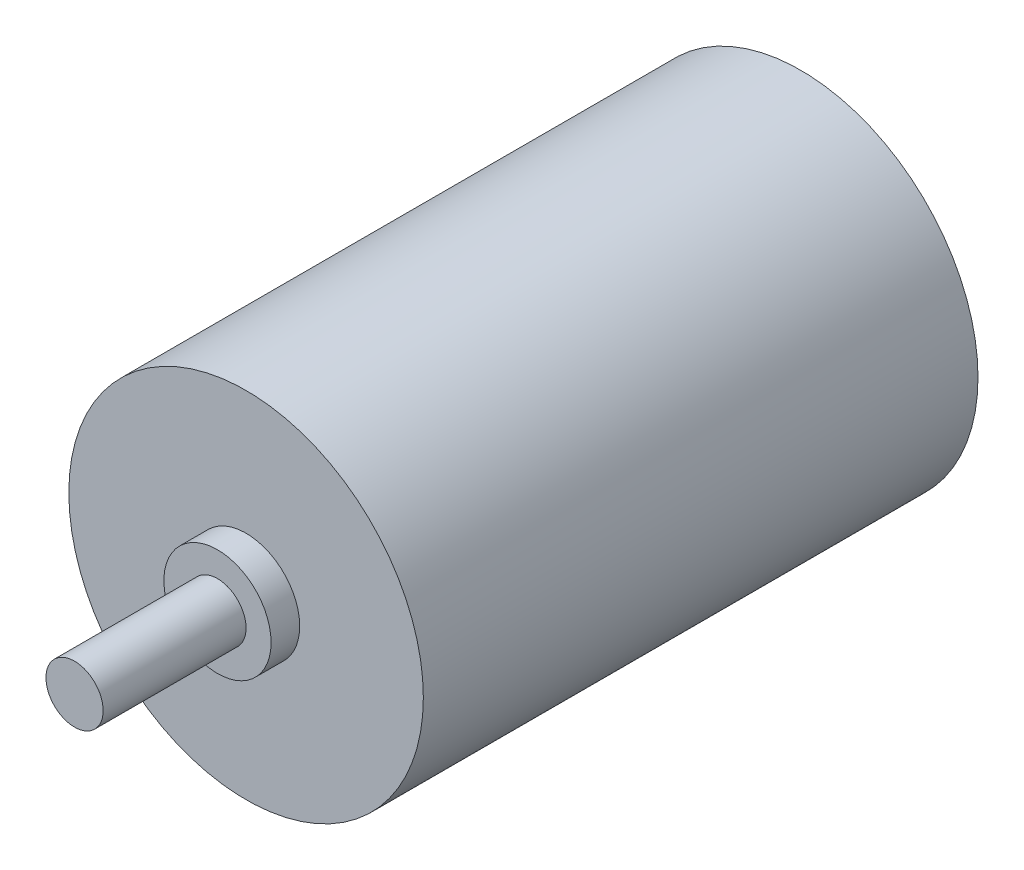
ISO-10303-21;
HEADER;
FILE_DESCRIPTION(('STEP AP214'),'2;1');
FILE_NAME('part.step','',(''),(''),'','','');
FILE_SCHEMA(('AUTOMOTIVE_DESIGN { 1 0 10303 214 1 1 1 1 }'));
ENDSEC;
DATA;
#1=APPLICATION_CONTEXT('core data for automotive mechanical design processes');
#2=APPLICATION_PROTOCOL_DEFINITION('international standard','automotive_design',2000,#1);
#3=PRODUCT_CONTEXT('',#1,'mechanical');
#4=PRODUCT('Part','Part','',(#3));
#5=PRODUCT_RELATED_PRODUCT_CATEGORY('part','',(#4));
#6=PRODUCT_DEFINITION_FORMATION('','',#4);
#7=PRODUCT_DEFINITION_CONTEXT('part definition',#1,'design');
#8=PRODUCT_DEFINITION('design','',#6,#7);
#9=PRODUCT_DEFINITION_SHAPE('','',#8);
#10=(LENGTH_UNIT() NAMED_UNIT(*) SI_UNIT(.MILLI.,.METRE.));
#11=(NAMED_UNIT(*) PLANE_ANGLE_UNIT() SI_UNIT($,.RADIAN.));
#12=(NAMED_UNIT(*) SI_UNIT($,.STERADIAN.) SOLID_ANGLE_UNIT());
#13=UNCERTAINTY_MEASURE_WITH_UNIT(LENGTH_MEASURE(1.E-05),#10,'distance_accuracy_value','');
#14=(GEOMETRIC_REPRESENTATION_CONTEXT(3) GLOBAL_UNCERTAINTY_ASSIGNED_CONTEXT((#13)) GLOBAL_UNIT_ASSIGNED_CONTEXT((#10,
#11,#12)) REPRESENTATION_CONTEXT('',''));
#15=CARTESIAN_POINT('',(0.,0.,0.));
#16=DIRECTION('',(0.,0.,1.));
#17=DIRECTION('',(1.,0.,0.));
#18=AXIS2_PLACEMENT_3D('',#15,#16,#17);
#19=CARTESIAN_POINT('',(0.,0.,0.));
#20=DIRECTION('',(0.,0.,1.));
#21=DIRECTION('',(1.,0.,0.));
#22=AXIS2_PLACEMENT_3D('',#19,#20,#21);
#23=PLANE('',#22);
#24=CARTESIAN_POINT('',(0.,0.,0.));
#25=DIRECTION('',(0.,0.,1.));
#26=DIRECTION('',(1.,0.,0.));
#27=AXIS2_PLACEMENT_3D('',#24,#25,#26);
#28=CIRCLE('',#27,12.4);
#29=CARTESIAN_POINT('',(12.4,0.,0.));
#30=VERTEX_POINT('',#29);
#31=EDGE_CURVE('E40',#30,#30,#28,.T.);
#32=ORIENTED_EDGE('',*,*,#31,.F.);
#33=EDGE_LOOP('',(#32));
#34=FACE_BOUND('',#33,.T.);
#35=DIRECTION('',(0.,-1.,0.));
#36=VECTOR('',#35,1.);
#37=CARTESIAN_POINT('',(3.5,-8.,0.));
#38=LINE('',#37,#36);
#39=CARTESIAN_POINT('',(3.5,-8.,0.));
#40=VERTEX_POINT('',#39);
#41=CARTESIAN_POINT('',(3.5,-10.,0.));
#42=VERTEX_POINT('',#41);
#43=EDGE_CURVE('E97',#40,#42,#38,.T.);
#44=ORIENTED_EDGE('',*,*,#43,.F.);
#45=DIRECTION('',(1.,0.,0.));
#46=VECTOR('',#45,1.);
#47=CARTESIAN_POINT('',(-3.5,-8.,0.));
#48=LINE('',#47,#46);
#49=CARTESIAN_POINT('',(-3.5,-8.,0.));
#50=VERTEX_POINT('',#49);
#51=EDGE_CURVE('E94',#50,#40,#48,.T.);
#52=ORIENTED_EDGE('',*,*,#51,.F.);
#53=DIRECTION('',(0.,1.,0.));
#54=VECTOR('',#53,1.);
#55=CARTESIAN_POINT('',(-3.5,-8.,0.));
#56=LINE('',#55,#54);
#57=CARTESIAN_POINT('',(-3.5,-10.,0.));
#58=VERTEX_POINT('',#57);
#59=EDGE_CURVE('E56',#58,#50,#56,.T.);
#60=ORIENTED_EDGE('',*,*,#59,.F.);
#61=DIRECTION('',(-1.,0.,0.));
#62=VECTOR('',#61,1.);
#63=CARTESIAN_POINT('',(-3.5,-10.,0.));
#64=LINE('',#63,#62);
#65=EDGE_CURVE('E51',#42,#58,#64,.T.);
#66=ORIENTED_EDGE('',*,*,#65,.F.);
#67=EDGE_LOOP('',(#44,#52,#60,#66));
#68=FACE_BOUND('',#67,.T.);
#69=ADVANCED_FACE('F36',(#34,#68),#23,.F.);
#70=CARTESIAN_POINT('',(0.,0.,38.8));
#71=DIRECTION('',(0.,0.,-1.));
#72=DIRECTION('',(-1.,0.,0.));
#73=AXIS2_PLACEMENT_3D('',#70,#71,#72);
#74=CYLINDRICAL_SURFACE('',#73,12.4);
#75=CARTESIAN_POINT('',(0.,0.,38.8));
#76=DIRECTION('',(0.,0.,1.));
#77=DIRECTION('',(1.,0.,0.));
#78=AXIS2_PLACEMENT_3D('',#75,#76,#77);
#79=CIRCLE('',#78,12.4);
#80=CARTESIAN_POINT('',(12.4,0.,38.8));
#81=VERTEX_POINT('',#80);
#82=EDGE_CURVE('E11',#81,#81,#79,.T.);
#83=ORIENTED_EDGE('',*,*,#82,.F.);
#84=EDGE_LOOP('',(#83));
#85=FACE_BOUND('',#84,.T.);
#86=ORIENTED_EDGE('',*,*,#31,.T.);
#87=EDGE_LOOP('',(#86));
#88=FACE_BOUND('',#87,.T.);
#89=ADVANCED_FACE('F38',(#85,#88),#74,.T.);
#90=CARTESIAN_POINT('',(0.,0.,38.8));
#91=DIRECTION('',(0.,0.,1.));
#92=DIRECTION('',(1.,0.,0.));
#93=AXIS2_PLACEMENT_3D('',#90,#91,#92);
#94=PLANE('',#93);
#95=CARTESIAN_POINT('',(0.,0.,38.8));
#96=DIRECTION('',(0.,0.,1.));
#97=DIRECTION('',(1.,0.,0.));
#98=AXIS2_PLACEMENT_3D('',#95,#96,#97);
#99=CIRCLE('',#98,3.75);
#100=CARTESIAN_POINT('',(3.75,0.,38.8));
#101=VERTEX_POINT('',#100);
#102=EDGE_CURVE('E108',#101,#101,#99,.T.);
#103=ORIENTED_EDGE('',*,*,#102,.F.);
#104=EDGE_LOOP('',(#103));
#105=FACE_BOUND('',#104,.T.);
#106=ORIENTED_EDGE('',*,*,#82,.T.);
#107=EDGE_LOOP('',(#106));
#108=FACE_BOUND('',#107,.T.);
#109=ADVANCED_FACE('F118',(#105,#108),#94,.T.);
#110=CARTESIAN_POINT('',(0.,0.,40.8));
#111=DIRECTION('',(0.,0.,-1.));
#112=DIRECTION('',(-1.,0.,0.));
#113=AXIS2_PLACEMENT_3D('',#110,#111,#112);
#114=CYLINDRICAL_SURFACE('',#113,3.75);
#115=CARTESIAN_POINT('',(0.,0.,40.8));
#116=DIRECTION('',(0.,0.,1.));
#117=DIRECTION('',(1.,0.,0.));
#118=AXIS2_PLACEMENT_3D('',#115,#116,#117);
#119=CIRCLE('',#118,3.75);
#120=CARTESIAN_POINT('',(3.75,0.,40.8));
#121=VERTEX_POINT('',#120);
#122=EDGE_CURVE('E110',#121,#121,#119,.T.);
#123=ORIENTED_EDGE('',*,*,#122,.F.);
#124=EDGE_LOOP('',(#123));
#125=FACE_BOUND('',#124,.T.);
#126=ORIENTED_EDGE('',*,*,#102,.T.);
#127=EDGE_LOOP('',(#126));
#128=FACE_BOUND('',#127,.T.);
#129=ADVANCED_FACE('F116',(#125,#128),#114,.T.);
#130=CARTESIAN_POINT('',(0.,0.,40.8));
#131=DIRECTION('',(0.,0.,1.));
#132=DIRECTION('',(1.,0.,0.));
#133=AXIS2_PLACEMENT_3D('',#130,#131,#132);
#134=PLANE('',#133);
#135=CARTESIAN_POINT('',(0.,0.,40.8));
#136=DIRECTION('',(0.,0.,1.));
#137=DIRECTION('',(1.,0.,0.));
#138=AXIS2_PLACEMENT_3D('',#135,#136,#137);
#139=CIRCLE('',#138,2.);
#140=CARTESIAN_POINT('',(2.,0.,40.8));
#141=VERTEX_POINT('',#140);
#142=EDGE_CURVE('E98',#141,#141,#139,.T.);
#143=ORIENTED_EDGE('',*,*,#142,.F.);
#144=EDGE_LOOP('',(#143));
#145=FACE_BOUND('',#144,.T.);
#146=ORIENTED_EDGE('',*,*,#122,.T.);
#147=EDGE_LOOP('',(#146));
#148=FACE_BOUND('',#147,.T.);
#149=ADVANCED_FACE('F164',(#145,#148),#134,.T.);
#150=CARTESIAN_POINT('',(0.,0.,50.8));
#151=DIRECTION('',(0.,0.,-1.));
#152=DIRECTION('',(-1.,0.,0.));
#153=AXIS2_PLACEMENT_3D('',#150,#151,#152);
#154=CYLINDRICAL_SURFACE('',#153,2.);
#155=CARTESIAN_POINT('',(0.,0.,50.8));
#156=DIRECTION('',(0.,0.,1.));
#157=DIRECTION('',(1.,0.,0.));
#158=AXIS2_PLACEMENT_3D('',#155,#156,#157);
#159=CIRCLE('',#158,2.);
#160=CARTESIAN_POINT('',(2.,0.,50.8));
#161=VERTEX_POINT('',#160);
#162=EDGE_CURVE('E101',#161,#161,#159,.T.);
#163=ORIENTED_EDGE('',*,*,#162,.F.);
#164=EDGE_LOOP('',(#163));
#165=FACE_BOUND('',#164,.T.);
#166=ORIENTED_EDGE('',*,*,#142,.T.);
#167=EDGE_LOOP('',(#166));
#168=FACE_BOUND('',#167,.T.);
#169=ADVANCED_FACE('F160',(#165,#168),#154,.T.);
#170=CARTESIAN_POINT('',(0.,0.,50.8));
#171=DIRECTION('',(0.,0.,1.));
#172=DIRECTION('',(1.,0.,0.));
#173=AXIS2_PLACEMENT_3D('',#170,#171,#172);
#174=PLANE('',#173);
#175=ORIENTED_EDGE('',*,*,#162,.T.);
#176=EDGE_LOOP('',(#175));
#177=FACE_BOUND('',#176,.T.);
#178=ADVANCED_FACE('F157',(#177),#174,.T.);
#179=CARTESIAN_POINT('',(3.5,-8.,-3.));
#180=DIRECTION('',(-1.,0.,0.));
#181=DIRECTION('',(0.,-1.,0.));
#182=AXIS2_PLACEMENT_3D('',#179,#180,#181);
#183=PLANE('',#182);
#184=ORIENTED_EDGE('',*,*,#43,.T.);
#185=DIRECTION('',(0.,0.,1.));
#186=VECTOR('',#185,1.);
#187=CARTESIAN_POINT('',(3.5,-10.,-3.));
#188=LINE('',#187,#186);
#189=CARTESIAN_POINT('',(3.5,-10.,-3.));
#190=VERTEX_POINT('',#189);
#191=EDGE_CURVE('E78',#190,#42,#188,.T.);
#192=ORIENTED_EDGE('',*,*,#191,.F.);
#193=DIRECTION('',(0.,-1.,0.));
#194=VECTOR('',#193,1.);
#195=CARTESIAN_POINT('',(3.5,-8.,-3.));
#196=LINE('',#195,#194);
#197=CARTESIAN_POINT('',(3.5,-8.,-3.));
#198=VERTEX_POINT('',#197);
#199=EDGE_CURVE('E85',#198,#190,#196,.T.);
#200=ORIENTED_EDGE('',*,*,#199,.F.);
#201=DIRECTION('',(0.,0.,1.));
#202=VECTOR('',#201,1.);
#203=CARTESIAN_POINT('',(3.5,-8.,-3.));
#204=LINE('',#203,#202);
#205=EDGE_CURVE('E135',#198,#40,#204,.T.);
#206=ORIENTED_EDGE('',*,*,#205,.T.);
#207=EDGE_LOOP('',(#184,#192,#200,#206));
#208=FACE_BOUND('',#207,.T.);
#209=ADVANCED_FACE('F96',(#208),#183,.F.);
#210=CARTESIAN_POINT('',(-3.5,-10.,-3.));
#211=DIRECTION('',(0.,1.,0.));
#212=DIRECTION('',(0.,0.,1.));
#213=AXIS2_PLACEMENT_3D('',#210,#211,#212);
#214=PLANE('',#213);
#215=ORIENTED_EDGE('',*,*,#65,.T.);
#216=DIRECTION('',(0.,0.,1.));
#217=VECTOR('',#216,1.);
#218=CARTESIAN_POINT('',(-3.5,-10.,-3.));
#219=LINE('',#218,#217);
#220=CARTESIAN_POINT('',(-3.5,-10.,-3.));
#221=VERTEX_POINT('',#220);
#222=EDGE_CURVE('E81',#221,#58,#219,.T.);
#223=ORIENTED_EDGE('',*,*,#222,.F.);
#224=DIRECTION('',(-1.,0.,0.));
#225=VECTOR('',#224,1.);
#226=CARTESIAN_POINT('',(-3.5,-10.,-3.));
#227=LINE('',#226,#225);
#228=EDGE_CURVE('E74',#190,#221,#227,.T.);
#229=ORIENTED_EDGE('',*,*,#228,.F.);
#230=ORIENTED_EDGE('',*,*,#191,.T.);
#231=EDGE_LOOP('',(#215,#223,#229,#230));
#232=FACE_BOUND('',#231,.T.);
#233=ADVANCED_FACE('F76',(#232),#214,.F.);
#234=CARTESIAN_POINT('',(-3.5,-8.,-3.));
#235=DIRECTION('',(1.,0.,0.));
#236=DIRECTION('',(0.,1.,0.));
#237=AXIS2_PLACEMENT_3D('',#234,#235,#236);
#238=PLANE('',#237);
#239=ORIENTED_EDGE('',*,*,#59,.T.);
#240=DIRECTION('',(0.,0.,1.));
#241=VECTOR('',#240,1.);
#242=CARTESIAN_POINT('',(-3.5,-8.,-3.));
#243=LINE('',#242,#241);
#244=CARTESIAN_POINT('',(-3.5,-8.,-3.));
#245=VERTEX_POINT('',#244);
#246=EDGE_CURVE('E103',#245,#50,#243,.T.);
#247=ORIENTED_EDGE('',*,*,#246,.F.);
#248=DIRECTION('',(0.,1.,0.));
#249=VECTOR('',#248,1.);
#250=CARTESIAN_POINT('',(-3.5,-8.,-3.));
#251=LINE('',#250,#249);
#252=EDGE_CURVE('E84',#221,#245,#251,.T.);
#253=ORIENTED_EDGE('',*,*,#252,.F.);
#254=ORIENTED_EDGE('',*,*,#222,.T.);
#255=EDGE_LOOP('',(#239,#247,#253,#254));
#256=FACE_BOUND('',#255,.T.);
#257=ADVANCED_FACE('F144',(#256),#238,.F.);
#258=CARTESIAN_POINT('',(-3.5,-8.,-3.));
#259=DIRECTION('',(0.,-1.,0.));
#260=DIRECTION('',(1.,0.,0.));
#261=AXIS2_PLACEMENT_3D('',#258,#259,#260);
#262=PLANE('',#261);
#263=ORIENTED_EDGE('',*,*,#51,.T.);
#264=ORIENTED_EDGE('',*,*,#205,.F.);
#265=DIRECTION('',(1.,0.,0.));
#266=VECTOR('',#265,1.);
#267=CARTESIAN_POINT('',(-3.5,-8.,-3.));
#268=LINE('',#267,#266);
#269=EDGE_CURVE('E90',#245,#198,#268,.T.);
#270=ORIENTED_EDGE('',*,*,#269,.F.);
#271=ORIENTED_EDGE('',*,*,#246,.T.);
#272=EDGE_LOOP('',(#263,#264,#270,#271));
#273=FACE_BOUND('',#272,.T.);
#274=ADVANCED_FACE('F134',(#273),#262,.F.);
#275=CARTESIAN_POINT('',(0.,0.,-3.));
#276=DIRECTION('',(0.,0.,1.));
#277=DIRECTION('',(1.,0.,0.));
#278=AXIS2_PLACEMENT_3D('',#275,#276,#277);
#279=PLANE('',#278);
#280=ORIENTED_EDGE('',*,*,#199,.T.);
#281=ORIENTED_EDGE('',*,*,#228,.T.);
#282=ORIENTED_EDGE('',*,*,#252,.T.);
#283=ORIENTED_EDGE('',*,*,#269,.T.);
#284=EDGE_LOOP('',(#280,#281,#282,#283));
#285=FACE_BOUND('',#284,.T.);
#286=ADVANCED_FACE('F88',(#285),#279,.F.);
#287=CLOSED_SHELL('',(#69,#89,#109,#129,#149,#169,#178,#209,#233,#257,#274,#286));
#288=MANIFOLD_SOLID_BREP('B2',#287);
#289=ADVANCED_BREP_SHAPE_REPRESENTATION('',(#18,#288),#14);
#290=SHAPE_DEFINITION_REPRESENTATION(#9,#289);
ENDSEC;
END-ISO-10303-21;
